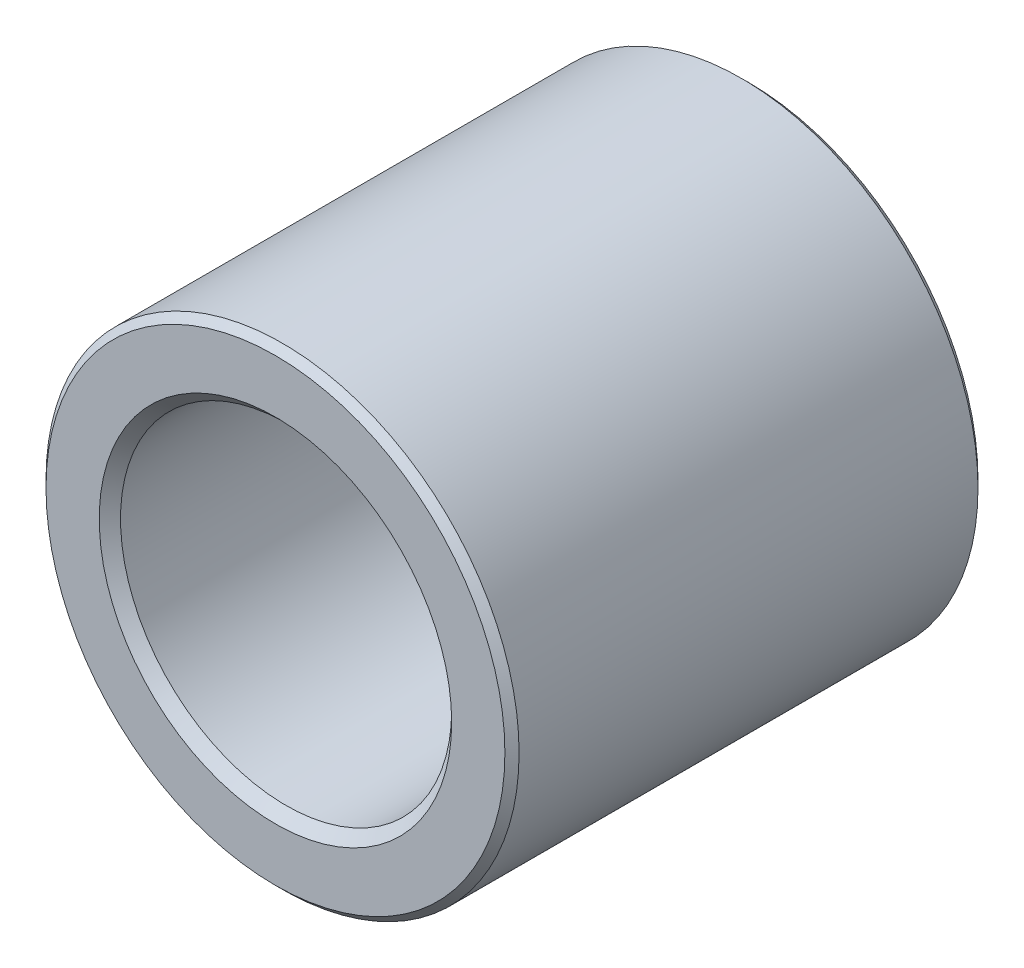
ISO-10303-21;
HEADER;
FILE_DESCRIPTION(('STEP AP214'),'2;1');
FILE_NAME('part.step','',(''),(''),'','','');
FILE_SCHEMA(('AUTOMOTIVE_DESIGN { 1 0 10303 214 1 1 1 1 }'));
ENDSEC;
DATA;
#1=APPLICATION_CONTEXT('core data for automotive mechanical design processes');
#2=APPLICATION_PROTOCOL_DEFINITION('international standard','automotive_design',2000,#1);
#3=PRODUCT_CONTEXT('',#1,'mechanical');
#4=PRODUCT('Part','Part','',(#3));
#5=PRODUCT_RELATED_PRODUCT_CATEGORY('part','',(#4));
#6=PRODUCT_DEFINITION_FORMATION('','',#4);
#7=PRODUCT_DEFINITION_CONTEXT('part definition',#1,'design');
#8=PRODUCT_DEFINITION('design','',#6,#7);
#9=PRODUCT_DEFINITION_SHAPE('','',#8);
#10=(LENGTH_UNIT() NAMED_UNIT(*) SI_UNIT(.MILLI.,.METRE.));
#11=(NAMED_UNIT(*) PLANE_ANGLE_UNIT() SI_UNIT($,.RADIAN.));
#12=(NAMED_UNIT(*) SI_UNIT($,.STERADIAN.) SOLID_ANGLE_UNIT());
#13=UNCERTAINTY_MEASURE_WITH_UNIT(LENGTH_MEASURE(1.E-05),#10,'distance_accuracy_value','');
#14=(GEOMETRIC_REPRESENTATION_CONTEXT(3) GLOBAL_UNCERTAINTY_ASSIGNED_CONTEXT((#13)) GLOBAL_UNIT_ASSIGNED_CONTEXT((#10,
#11,#12)) REPRESENTATION_CONTEXT('',''));
#15=CARTESIAN_POINT('',(0.,0.,0.));
#16=DIRECTION('',(0.,0.,1.));
#17=DIRECTION('',(1.,0.,0.));
#18=AXIS2_PLACEMENT_3D('',#15,#16,#17);
#19=CARTESIAN_POINT('',(0.,0.,-3.));
#20=DIRECTION('',(0.,0.,1.));
#21=DIRECTION('',(1.,0.,0.));
#22=AXIS2_PLACEMENT_3D('',#19,#20,#21);
#23=CYLINDRICAL_SURFACE('',#22,3.);
#24=CARTESIAN_POINT('',(0.,0.,2.91));
#25=DIRECTION('',(0.,0.,1.));
#26=DIRECTION('',(1.,0.,0.));
#27=AXIS2_PLACEMENT_3D('',#24,#25,#26);
#28=CIRCLE('',#27,3.);
#29=CARTESIAN_POINT('',(-3.,0.,2.91));
#30=VERTEX_POINT('',#29);
#31=EDGE_CURVE('E58',#30,#30,#28,.F.);
#32=ORIENTED_EDGE('',*,*,#31,.T.);
#33=EDGE_LOOP('',(#32));
#34=FACE_BOUND('',#33,.T.);
#35=CARTESIAN_POINT('',(0.,0.,-2.91));
#36=DIRECTION('',(0.,0.,1.));
#37=DIRECTION('',(1.,0.,0.));
#38=AXIS2_PLACEMENT_3D('',#35,#36,#37);
#39=CIRCLE('',#38,3.);
#40=CARTESIAN_POINT('',(3.,0.,-2.91));
#41=VERTEX_POINT('',#40);
#42=EDGE_CURVE('E61',#41,#41,#39,.T.);
#43=ORIENTED_EDGE('',*,*,#42,.T.);
#44=EDGE_LOOP('',(#43));
#45=FACE_BOUND('',#44,.T.);
#46=ADVANCED_FACE('F35',(#34,#45),#23,.T.);
#47=CARTESIAN_POINT('',(0.,0.,-3.));
#48=DIRECTION('',(0.,0.,1.));
#49=DIRECTION('',(1.,0.,0.));
#50=AXIS2_PLACEMENT_3D('',#47,#48,#49);
#51=PLANE('',#50);
#52=CARTESIAN_POINT('',(0.,0.,-3.));
#53=DIRECTION('',(0.,0.,1.));
#54=DIRECTION('',(1.,0.,0.));
#55=AXIS2_PLACEMENT_3D('',#52,#53,#54);
#56=CIRCLE('',#55,2.235);
#57=CARTESIAN_POINT('',(2.235,0.,-3.));
#58=VERTEX_POINT('',#57);
#59=EDGE_CURVE('E10',#58,#58,#56,.T.);
#60=ORIENTED_EDGE('',*,*,#59,.T.);
#61=EDGE_LOOP('',(#60));
#62=FACE_BOUND('',#61,.T.);
#63=CARTESIAN_POINT('',(0.,0.,-3.));
#64=DIRECTION('',(0.,0.,1.));
#65=DIRECTION('',(1.,0.,0.));
#66=AXIS2_PLACEMENT_3D('',#63,#64,#65);
#67=CIRCLE('',#66,2.91);
#68=CARTESIAN_POINT('',(2.91,0.,-3.));
#69=VERTEX_POINT('',#68);
#70=EDGE_CURVE('E55',#69,#69,#67,.F.);
#71=ORIENTED_EDGE('',*,*,#70,.T.);
#72=EDGE_LOOP('',(#71));
#73=FACE_BOUND('',#72,.T.);
#74=ADVANCED_FACE('F87',(#62,#73),#51,.F.);
#75=CARTESIAN_POINT('',(0.,0.,-3.));
#76=DIRECTION('',(0.,0.,1.));
#77=DIRECTION('',(1.,0.,0.));
#78=AXIS2_PLACEMENT_3D('',#75,#76,#77);
#79=CYLINDRICAL_SURFACE('',#78,2.1);
#80=CARTESIAN_POINT('',(0.,0.,2.865));
#81=DIRECTION('',(0.,0.,1.));
#82=DIRECTION('',(1.,0.,0.));
#83=AXIS2_PLACEMENT_3D('',#80,#81,#82);
#84=CIRCLE('',#83,2.1);
#85=CARTESIAN_POINT('',(2.1,0.,2.865));
#86=VERTEX_POINT('',#85);
#87=EDGE_CURVE('E46',#86,#86,#84,.T.);
#88=ORIENTED_EDGE('',*,*,#87,.T.);
#89=EDGE_LOOP('',(#88));
#90=FACE_BOUND('',#89,.T.);
#91=CARTESIAN_POINT('',(0.,0.,-2.865));
#92=DIRECTION('',(0.,0.,1.));
#93=DIRECTION('',(1.,0.,0.));
#94=AXIS2_PLACEMENT_3D('',#91,#92,#93);
#95=CIRCLE('',#94,2.1);
#96=CARTESIAN_POINT('',(2.1,0.,-2.865));
#97=VERTEX_POINT('',#96);
#98=EDGE_CURVE('E50',#97,#97,#95,.F.);
#99=ORIENTED_EDGE('',*,*,#98,.T.);
#100=EDGE_LOOP('',(#99));
#101=FACE_BOUND('',#100,.T.);
#102=ADVANCED_FACE('F83',(#90,#101),#79,.F.);
#103=CARTESIAN_POINT('',(0.,0.,3.));
#104=DIRECTION('',(0.,0.,1.));
#105=DIRECTION('',(1.,0.,0.));
#106=AXIS2_PLACEMENT_3D('',#103,#104,#105);
#107=PLANE('',#106);
#108=CARTESIAN_POINT('',(0.,0.,3.));
#109=DIRECTION('',(0.,0.,1.));
#110=DIRECTION('',(1.,0.,0.));
#111=AXIS2_PLACEMENT_3D('',#108,#109,#110);
#112=CIRCLE('',#111,2.235);
#113=CARTESIAN_POINT('',(2.235,0.,3.));
#114=VERTEX_POINT('',#113);
#115=EDGE_CURVE('E42',#114,#114,#112,.F.);
#116=ORIENTED_EDGE('',*,*,#115,.T.);
#117=EDGE_LOOP('',(#116));
#118=FACE_BOUND('',#117,.T.);
#119=CARTESIAN_POINT('',(0.,0.,3.));
#120=DIRECTION('',(0.,0.,1.));
#121=DIRECTION('',(1.,0.,0.));
#122=AXIS2_PLACEMENT_3D('',#119,#120,#121);
#123=CIRCLE('',#122,2.91);
#124=CARTESIAN_POINT('',(-2.91,0.,3.));
#125=VERTEX_POINT('',#124);
#126=EDGE_CURVE('E64',#125,#125,#123,.T.);
#127=ORIENTED_EDGE('',*,*,#126,.T.);
#128=EDGE_LOOP('',(#127));
#129=FACE_BOUND('',#128,.T.);
#130=ADVANCED_FACE('F68',(#118,#129),#107,.T.);
#131=CARTESIAN_POINT('',(0.,0.,3.));
#132=DIRECTION('',(0.,0.,-1.));
#133=DIRECTION('',(-1.,0.,0.));
#134=AXIS2_PLACEMENT_3D('',#131,#132,#133);
#135=CONICAL_SURFACE('',#134,2.91,0.785398163397446);
#136=CARTESIAN_POINT('',(-3.,0.,2.91));
#137=CARTESIAN_POINT('',(-2.9990625,0.,2.9109375));
#138=CARTESIAN_POINT('',(-2.998125,0.,2.911875));
#139=CARTESIAN_POINT('',(-2.99625,0.,2.91375));
#140=CARTESIAN_POINT('',(-2.9953125,0.,2.9146875));
#141=CARTESIAN_POINT('',(-2.9934375,0.,2.9165625));
#142=CARTESIAN_POINT('',(-2.9925,0.,2.9175));
#143=CARTESIAN_POINT('',(-2.990625,0.,2.919375));
#144=CARTESIAN_POINT('',(-2.9896875,0.,2.9203125));
#145=CARTESIAN_POINT('',(-2.9878125,0.,2.9221875));
#146=CARTESIAN_POINT('',(-2.986875,0.,2.923125));
#147=CARTESIAN_POINT('',(-2.985,0.,2.925));
#148=CARTESIAN_POINT('',(-2.9840625,0.,2.9259375));
#149=CARTESIAN_POINT('',(-2.9821875,0.,2.9278125));
#150=CARTESIAN_POINT('',(-2.98125,0.,2.92875));
#151=CARTESIAN_POINT('',(-2.979375,0.,2.930625));
#152=CARTESIAN_POINT('',(-2.9784375,0.,2.9315625));
#153=CARTESIAN_POINT('',(-2.9765625,0.,2.9334375));
#154=CARTESIAN_POINT('',(-2.975625,0.,2.934375));
#155=CARTESIAN_POINT('',(-2.97375,0.,2.93625));
#156=CARTESIAN_POINT('',(-2.9728125,0.,2.9371875));
#157=CARTESIAN_POINT('',(-2.9709375,0.,2.9390625));
#158=CARTESIAN_POINT('',(-2.97,0.,2.94));
#159=CARTESIAN_POINT('',(-2.968125,0.,2.941875));
#160=CARTESIAN_POINT('',(-2.9671875,0.,2.9428125));
#161=CARTESIAN_POINT('',(-2.9653125,0.,2.9446875));
#162=CARTESIAN_POINT('',(-2.964375,0.,2.945625));
#163=CARTESIAN_POINT('',(-2.9625,0.,2.9475));
#164=CARTESIAN_POINT('',(-2.9615625,0.,2.9484375));
#165=CARTESIAN_POINT('',(-2.9596875,0.,2.9503125));
#166=CARTESIAN_POINT('',(-2.95875,0.,2.95125));
#167=CARTESIAN_POINT('',(-2.956875,0.,2.953125));
#168=CARTESIAN_POINT('',(-2.9559375,0.,2.9540625));
#169=CARTESIAN_POINT('',(-2.9540625,0.,2.9559375));
#170=CARTESIAN_POINT('',(-2.953125,0.,2.956875));
#171=CARTESIAN_POINT('',(-2.95125,0.,2.95875));
#172=CARTESIAN_POINT('',(-2.9503125,0.,2.9596875));
#173=CARTESIAN_POINT('',(-2.9484375,0.,2.9615625));
#174=CARTESIAN_POINT('',(-2.9475,0.,2.9625));
#175=CARTESIAN_POINT('',(-2.945625,0.,2.964375));
#176=CARTESIAN_POINT('',(-2.9446875,0.,2.9653125));
#177=CARTESIAN_POINT('',(-2.9428125,0.,2.9671875));
#178=CARTESIAN_POINT('',(-2.941875,0.,2.968125));
#179=CARTESIAN_POINT('',(-2.94,0.,2.97));
#180=CARTESIAN_POINT('',(-2.9390625,0.,2.9709375));
#181=CARTESIAN_POINT('',(-2.9371875,0.,2.9728125));
#182=CARTESIAN_POINT('',(-2.93625,0.,2.97375));
#183=CARTESIAN_POINT('',(-2.934375,0.,2.975625));
#184=CARTESIAN_POINT('',(-2.9334375,0.,2.9765625));
#185=CARTESIAN_POINT('',(-2.9315625,0.,2.9784375));
#186=CARTESIAN_POINT('',(-2.930625,0.,2.979375));
#187=CARTESIAN_POINT('',(-2.92875,0.,2.98125));
#188=CARTESIAN_POINT('',(-2.9278125,0.,2.9821875));
#189=CARTESIAN_POINT('',(-2.9259375,0.,2.9840625));
#190=CARTESIAN_POINT('',(-2.925,0.,2.985));
#191=CARTESIAN_POINT('',(-2.923125,0.,2.986875));
#192=CARTESIAN_POINT('',(-2.9221875,0.,2.9878125));
#193=CARTESIAN_POINT('',(-2.9203125,0.,2.9896875));
#194=CARTESIAN_POINT('',(-2.919375,0.,2.990625));
#195=CARTESIAN_POINT('',(-2.9175,0.,2.9925));
#196=CARTESIAN_POINT('',(-2.9165625,0.,2.9934375));
#197=CARTESIAN_POINT('',(-2.9146875,0.,2.9953125));
#198=CARTESIAN_POINT('',(-2.91375,0.,2.99625));
#199=CARTESIAN_POINT('',(-2.911875,0.,2.998125));
#200=CARTESIAN_POINT('',(-2.9109375,0.,2.9990625));
#201=CARTESIAN_POINT('',(-2.91,0.,3.));
#202=B_SPLINE_CURVE_WITH_KNOTS('',3,(#136,#137,#138,#139,#140,#141,#142,#143,#144,#145,#146,
#147,#148,#149,#150,#151,#152,#153,#154,#155,#156,#157,#158,#159,#160,#161,#162,#163,#164,#165,
#166,#167,#168,#169,#170,#171,#172,#173,#174,#175,#176,#177,#178,#179,#180,#181,#182,#183,#184,
#185,#186,#187,#188,#189,#190,#191,#192,#193,#194,#195,#196,#197,#198,#199,#200,#201),
.UNSPECIFIED.,.F.,.F.,(4,2,2,2,2,2,2,2,2,2,2,2,2,2,2,2,2,2,2,2,2,2,2,2,2,2,2,2,2,2,2,2,4),(0.,
0.00397747564417463,0.00795495128834895,0.0119324269325233,0.0159099025766979,
0.0198873782208719,0.0238648538650465,0.0278423295092206,0.0318198051533952,0.0357972807975695,
0.0397747564417438,0.0437522320859181,0.0477297077300925,0.0517071833742668,0.0556846590184411,
0.0596621346626154,0.0636396103067898,0.0676170859509641,0.0715945615951387,0.075572037239313,
0.0795495128834874,0.0835269885276617,0.087504464171836,0.0914819398160103,0.0954594154601846,
0.0994368911043593,0.103414366748533,0.107391842392708,0.111369318036882,0.115346793681057,
0.119324269325231,0.123301744969405,0.12727922061358),.UNSPECIFIED.);
#203=EDGE_CURVE('BSEAM70',#30,#125,#202,.T.);
#204=ORIENTED_EDGE('',*,*,#31,.F.);
#205=ORIENTED_EDGE('',*,*,#126,.F.);
#206=ORIENTED_EDGE('',*,*,#203,.T.);
#207=ORIENTED_EDGE('',*,*,#203,.F.);
#208=EDGE_LOOP('',(#204,#206,#205,#207));
#209=FACE_BOUND('',#208,.T.);
#210=ADVANCED_FACE('F70',(#209),#135,.T.);
#211=CARTESIAN_POINT('',(0.,0.,-2.91));
#212=DIRECTION('',(0.,0.,1.));
#213=DIRECTION('',(1.,0.,0.));
#214=AXIS2_PLACEMENT_3D('',#211,#212,#213);
#215=CONICAL_SURFACE('',#214,3.,0.785398163397453);
#216=ORIENTED_EDGE('',*,*,#70,.F.);
#217=EDGE_LOOP('',(#216));
#218=FACE_BOUND('',#217,.T.);
#219=ORIENTED_EDGE('',*,*,#42,.F.);
#220=EDGE_LOOP('',(#219));
#221=FACE_BOUND('',#220,.T.);
#222=ADVANCED_FACE('F72',(#218,#221),#215,.T.);
#223=CARTESIAN_POINT('',(0.,0.,2.865));
#224=DIRECTION('',(0.,0.,1.));
#225=DIRECTION('',(1.,0.,0.));
#226=AXIS2_PLACEMENT_3D('',#223,#224,#225);
#227=CONICAL_SURFACE('',#226,2.1,0.785398163397448);
#228=ORIENTED_EDGE('',*,*,#115,.F.);
#229=EDGE_LOOP('',(#228));
#230=FACE_BOUND('',#229,.T.);
#231=ORIENTED_EDGE('',*,*,#87,.F.);
#232=EDGE_LOOP('',(#231));
#233=FACE_BOUND('',#232,.T.);
#234=ADVANCED_FACE('F79',(#230,#233),#227,.F.);
#235=CARTESIAN_POINT('',(0.,0.,-3.));
#236=DIRECTION('',(0.,0.,-1.));
#237=DIRECTION('',(-1.,0.,0.));
#238=AXIS2_PLACEMENT_3D('',#235,#236,#237);
#239=CONICAL_SURFACE('',#238,2.235,0.785398163397445);
#240=ORIENTED_EDGE('',*,*,#98,.F.);
#241=EDGE_LOOP('',(#240));
#242=FACE_BOUND('',#241,.T.);
#243=ORIENTED_EDGE('',*,*,#59,.F.);
#244=EDGE_LOOP('',(#243));
#245=FACE_BOUND('',#244,.T.);
#246=ADVANCED_FACE('F37',(#242,#245),#239,.F.);
#247=CLOSED_SHELL('',(#46,#74,#102,#130,#210,#222,#234,#246));
#248=MANIFOLD_SOLID_BREP('B2',#247);
#249=ADVANCED_BREP_SHAPE_REPRESENTATION('',(#18,#248),#14);
#250=SHAPE_DEFINITION_REPRESENTATION(#9,#249);
ENDSEC;
END-ISO-10303-21;
